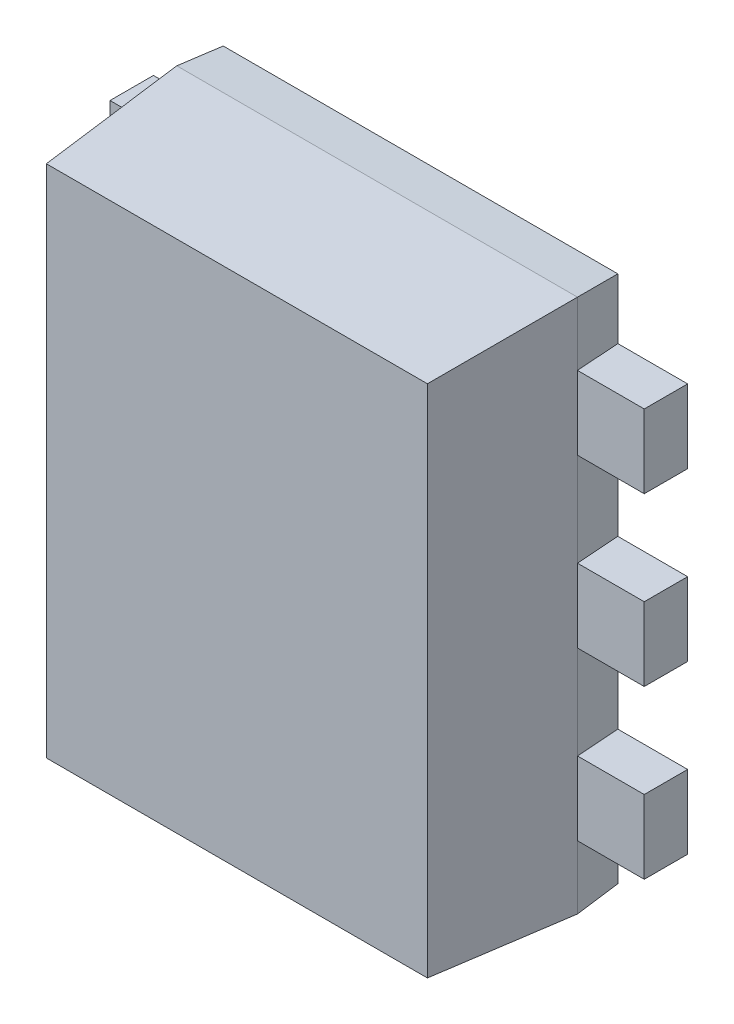
ISO-10303-21;
HEADER;
FILE_DESCRIPTION(('STEP AP214'),'2;1');
FILE_NAME('part.step','',(''),(''),'','','');
FILE_SCHEMA(('AUTOMOTIVE_DESIGN { 1 0 10303 214 1 1 1 1 }'));
ENDSEC;
DATA;
#1=APPLICATION_CONTEXT('core data for automotive mechanical design processes');
#2=APPLICATION_PROTOCOL_DEFINITION('international standard','automotive_design',2000,#1);
#3=PRODUCT_CONTEXT('',#1,'mechanical');
#4=PRODUCT('Part','Part','',(#3));
#5=PRODUCT_RELATED_PRODUCT_CATEGORY('part','',(#4));
#6=PRODUCT_DEFINITION_FORMATION('','',#4);
#7=PRODUCT_DEFINITION_CONTEXT('part definition',#1,'design');
#8=PRODUCT_DEFINITION('design','',#6,#7);
#9=PRODUCT_DEFINITION_SHAPE('','',#8);
#10=(LENGTH_UNIT() NAMED_UNIT(*) SI_UNIT(.MILLI.,.METRE.));
#11=(NAMED_UNIT(*) PLANE_ANGLE_UNIT() SI_UNIT($,.RADIAN.));
#12=(NAMED_UNIT(*) SI_UNIT($,.STERADIAN.) SOLID_ANGLE_UNIT());
#13=UNCERTAINTY_MEASURE_WITH_UNIT(LENGTH_MEASURE(1.E-05),#10,'distance_accuracy_value','');
#14=(GEOMETRIC_REPRESENTATION_CONTEXT(3) GLOBAL_UNCERTAINTY_ASSIGNED_CONTEXT((#13)) GLOBAL_UNIT_ASSIGNED_CONTEXT((#10,
#11,#12)) REPRESENTATION_CONTEXT('',''));
#15=CARTESIAN_POINT('',(0.,0.,0.));
#16=DIRECTION('',(0.,0.,1.));
#17=DIRECTION('',(1.,0.,0.));
#18=AXIS2_PLACEMENT_3D('',#15,#16,#17);
#19=CARTESIAN_POINT('',(0.6,-0.8,0.13));
#20=DIRECTION('',(0.99756405025987,0.,0.0697564737434767));
#21=DIRECTION('',(0.,1.,0.));
#22=AXIS2_PLACEMENT_3D('',#19,#20,#21);
#23=PLANE('',#22);
#24=DIRECTION('',(0.,1.,0.));
#25=VECTOR('',#24,1.);
#26=CARTESIAN_POINT('',(0.570630738984,0.770630738984,0.55));
#27=LINE('',#26,#25);
#28=CARTESIAN_POINT('',(0.570630738984,0.770630738984,0.55));
#29=VERTEX_POINT('',#28);
#30=CARTESIAN_POINT('',(0.570630738984,-0.770630738984,0.55));
#31=VERTEX_POINT('',#30);
#32=EDGE_CURVE('E396',#29,#31,#27,.F.);
#33=ORIENTED_EDGE('',*,*,#32,.T.);
#34=DIRECTION('',(0.0695873743160207,-0.0695873743160207,-0.995145815783599));
#35=VECTOR('',#34,1.);
#36=CARTESIAN_POINT('',(0.585315369492,-0.785315369492,0.34));
#37=LINE('',#36,#35);
#38=CARTESIAN_POINT('',(0.6,-0.8,0.13));
#39=VERTEX_POINT('',#38);
#40=EDGE_CURVE('E450',#31,#39,#37,.T.);
#41=ORIENTED_EDGE('',*,*,#40,.T.);
#42=DIRECTION('',(0.,1.,0.));
#43=VECTOR('',#42,1.);
#44=CARTESIAN_POINT('',(0.6,0.,0.13));
#45=LINE('',#44,#43);
#46=CARTESIAN_POINT('',(0.6,-0.61,0.13));
#47=VERTEX_POINT('',#46);
#48=EDGE_CURVE('E458',#39,#47,#45,.T.);
#49=ORIENTED_EDGE('',*,*,#48,.T.);
#50=DIRECTION('',(0.,1.,0.));
#51=VECTOR('',#50,1.);
#52=CARTESIAN_POINT('',(0.6,-0.61,0.13));
#53=LINE('',#52,#51);
#54=CARTESIAN_POINT('',(0.6,-0.39,0.13));
#55=VERTEX_POINT('',#54);
#56=EDGE_CURVE('E423',#55,#47,#53,.F.);
#57=ORIENTED_EDGE('',*,*,#56,.F.);
#58=DIRECTION('',(0.,1.,0.));
#59=VECTOR('',#58,1.);
#60=CARTESIAN_POINT('',(0.6,0.,0.13));
#61=LINE('',#60,#59);
#62=CARTESIAN_POINT('',(0.6,-0.11,0.13));
#63=VERTEX_POINT('',#62);
#64=EDGE_CURVE('E455',#55,#63,#61,.T.);
#65=ORIENTED_EDGE('',*,*,#64,.T.);
#66=DIRECTION('',(0.,1.,0.));
#67=VECTOR('',#66,1.);
#68=CARTESIAN_POINT('',(0.6,-0.11,0.13));
#69=LINE('',#68,#67);
#70=CARTESIAN_POINT('',(0.6,0.11,0.13));
#71=VERTEX_POINT('',#70);
#72=EDGE_CURVE('E438',#71,#63,#69,.F.);
#73=ORIENTED_EDGE('',*,*,#72,.F.);
#74=DIRECTION('',(0.,1.,0.));
#75=VECTOR('',#74,1.);
#76=CARTESIAN_POINT('',(0.6,0.,0.13));
#77=LINE('',#76,#75);
#78=CARTESIAN_POINT('',(0.6,0.39,0.13));
#79=VERTEX_POINT('',#78);
#80=EDGE_CURVE('E457',#71,#79,#77,.T.);
#81=ORIENTED_EDGE('',*,*,#80,.T.);
#82=DIRECTION('',(0.,1.,0.));
#83=VECTOR('',#82,1.);
#84=CARTESIAN_POINT('',(0.6,0.39,0.13));
#85=LINE('',#84,#83);
#86=CARTESIAN_POINT('',(0.6,0.61,0.13));
#87=VERTEX_POINT('',#86);
#88=EDGE_CURVE('E447',#87,#79,#85,.F.);
#89=ORIENTED_EDGE('',*,*,#88,.F.);
#90=DIRECTION('',(0.,1.,0.));
#91=VECTOR('',#90,1.);
#92=CARTESIAN_POINT('',(0.6,0.,0.13));
#93=LINE('',#92,#91);
#94=CARTESIAN_POINT('',(0.6,0.8,0.13));
#95=VERTEX_POINT('',#94);
#96=EDGE_CURVE('E462',#87,#95,#93,.T.);
#97=ORIENTED_EDGE('',*,*,#96,.T.);
#98=DIRECTION('',(-0.0695873743160207,-0.0695873743160207,0.995145815783599));
#99=VECTOR('',#98,1.);
#100=CARTESIAN_POINT('',(0.585315369492,0.785315369492,0.34));
#101=LINE('',#100,#99);
#102=EDGE_CURVE('E465',#95,#29,#101,.T.);
#103=ORIENTED_EDGE('',*,*,#102,.T.);
#104=EDGE_LOOP('',(#33,#41,#49,#57,#65,#73,#81,#89,#97,#103));
#105=FACE_BOUND('',#104,.T.);
#106=ADVANCED_FACE('F17',(#105),#23,.T.);
#107=CARTESIAN_POINT('',(0.590909514447,0.39,0.13));
#108=DIRECTION('',(0.,0.,1.));
#109=DIRECTION('',(1.,0.,0.));
#110=AXIS2_PLACEMENT_3D('',#107,#108,#109);
#111=PLANE('',#110);
#112=DIRECTION('',(0.,1.,0.));
#113=VECTOR('',#112,1.);
#114=CARTESIAN_POINT('',(0.8,0.39,0.13));
#115=LINE('',#114,#113);
#116=CARTESIAN_POINT('',(0.8,0.61,0.13));
#117=VERTEX_POINT('',#116);
#118=CARTESIAN_POINT('',(0.8,0.39,0.13));
#119=VERTEX_POINT('',#118);
#120=EDGE_CURVE('E390',#117,#119,#115,.F.);
#121=ORIENTED_EDGE('',*,*,#120,.F.);
#122=DIRECTION('',(-1.,0.,0.));
#123=VECTOR('',#122,1.);
#124=CARTESIAN_POINT('',(0.590909514447,0.61,0.13));
#125=LINE('',#124,#123);
#126=EDGE_CURVE('E387',#87,#117,#125,.F.);
#127=ORIENTED_EDGE('',*,*,#126,.F.);
#128=ORIENTED_EDGE('',*,*,#88,.T.);
#129=DIRECTION('',(-1.,0.,0.));
#130=VECTOR('',#129,1.);
#131=CARTESIAN_POINT('',(0.590909514447,0.39,0.13));
#132=LINE('',#131,#130);
#133=EDGE_CURVE('E370',#79,#119,#132,.F.);
#134=ORIENTED_EDGE('',*,*,#133,.T.);
#135=EDGE_LOOP('',(#121,#127,#128,#134));
#136=FACE_BOUND('',#135,.T.);
#137=ADVANCED_FACE('F708',(#136),#111,.T.);
#138=CARTESIAN_POINT('',(0.590909514447,-0.11,0.13));
#139=DIRECTION('',(0.,0.,1.));
#140=DIRECTION('',(1.,0.,0.));
#141=AXIS2_PLACEMENT_3D('',#138,#139,#140);
#142=PLANE('',#141);
#143=DIRECTION('',(0.,1.,0.));
#144=VECTOR('',#143,1.);
#145=CARTESIAN_POINT('',(0.8,-0.11,0.13));
#146=LINE('',#145,#144);
#147=CARTESIAN_POINT('',(0.8,0.11,0.13));
#148=VERTEX_POINT('',#147);
#149=CARTESIAN_POINT('',(0.8,-0.11,0.13));
#150=VERTEX_POINT('',#149);
#151=EDGE_CURVE('E356',#148,#150,#146,.F.);
#152=ORIENTED_EDGE('',*,*,#151,.F.);
#153=DIRECTION('',(-1.,0.,0.));
#154=VECTOR('',#153,1.);
#155=CARTESIAN_POINT('',(0.590909514447,0.11,0.13));
#156=LINE('',#155,#154);
#157=EDGE_CURVE('E355',#71,#148,#156,.F.);
#158=ORIENTED_EDGE('',*,*,#157,.F.);
#159=ORIENTED_EDGE('',*,*,#72,.T.);
#160=DIRECTION('',(-1.,0.,0.));
#161=VECTOR('',#160,1.);
#162=CARTESIAN_POINT('',(0.590909514447,-0.11,0.13));
#163=LINE('',#162,#161);
#164=EDGE_CURVE('E341',#63,#150,#163,.F.);
#165=ORIENTED_EDGE('',*,*,#164,.T.);
#166=EDGE_LOOP('',(#152,#158,#159,#165));
#167=FACE_BOUND('',#166,.T.);
#168=ADVANCED_FACE('F704',(#167),#142,.T.);
#169=CARTESIAN_POINT('',(0.590909514447,-0.61,0.13));
#170=DIRECTION('',(0.,0.,1.));
#171=DIRECTION('',(1.,0.,0.));
#172=AXIS2_PLACEMENT_3D('',#169,#170,#171);
#173=PLANE('',#172);
#174=DIRECTION('',(0.,1.,0.));
#175=VECTOR('',#174,1.);
#176=CARTESIAN_POINT('',(0.8,-0.61,0.13));
#177=LINE('',#176,#175);
#178=CARTESIAN_POINT('',(0.8,-0.39,0.13));
#179=VERTEX_POINT('',#178);
#180=CARTESIAN_POINT('',(0.8,-0.61,0.13));
#181=VERTEX_POINT('',#180);
#182=EDGE_CURVE('E340',#179,#181,#177,.F.);
#183=ORIENTED_EDGE('',*,*,#182,.F.);
#184=DIRECTION('',(-1.,0.,0.));
#185=VECTOR('',#184,1.);
#186=CARTESIAN_POINT('',(0.590909514447,-0.39,0.13));
#187=LINE('',#186,#185);
#188=EDGE_CURVE('E347',#55,#179,#187,.F.);
#189=ORIENTED_EDGE('',*,*,#188,.F.);
#190=ORIENTED_EDGE('',*,*,#56,.T.);
#191=DIRECTION('',(-1.,0.,0.));
#192=VECTOR('',#191,1.);
#193=CARTESIAN_POINT('',(0.590909514447,-0.61,0.13));
#194=LINE('',#193,#192);
#195=EDGE_CURVE('E326',#47,#181,#194,.F.);
#196=ORIENTED_EDGE('',*,*,#195,.T.);
#197=EDGE_LOOP('',(#183,#189,#190,#196));
#198=FACE_BOUND('',#197,.T.);
#199=ADVANCED_FACE('F701',(#198),#173,.T.);
#200=CARTESIAN_POINT('',(-0.590909514447,0.11,0.13));
#201=DIRECTION('',(0.,0.,1.));
#202=DIRECTION('',(1.,0.,0.));
#203=AXIS2_PLACEMENT_3D('',#200,#201,#202);
#204=PLANE('',#203);
#205=DIRECTION('',(0.,-1.,0.));
#206=VECTOR('',#205,1.);
#207=CARTESIAN_POINT('',(-0.8,0.11,0.13));
#208=LINE('',#207,#206);
#209=CARTESIAN_POINT('',(-0.8,-0.11,0.13));
#210=VERTEX_POINT('',#209);
#211=CARTESIAN_POINT('',(-0.8,0.11,0.13));
#212=VERTEX_POINT('',#211);
#213=EDGE_CURVE('E263',#210,#212,#208,.F.);
#214=ORIENTED_EDGE('',*,*,#213,.F.);
#215=DIRECTION('',(1.,0.,0.));
#216=VECTOR('',#215,1.);
#217=CARTESIAN_POINT('',(-0.590909514447,-0.11,0.13));
#218=LINE('',#217,#216);
#219=CARTESIAN_POINT('',(-0.6,-0.11,0.13));
#220=VERTEX_POINT('',#219);
#221=EDGE_CURVE('E262',#220,#210,#218,.F.);
#222=ORIENTED_EDGE('',*,*,#221,.F.);
#223=DIRECTION('',(0.,-1.,0.));
#224=VECTOR('',#223,1.);
#225=CARTESIAN_POINT('',(-0.6,0.,0.13));
#226=LINE('',#225,#224);
#227=CARTESIAN_POINT('',(-0.6,0.11,0.13));
#228=VERTEX_POINT('',#227);
#229=EDGE_CURVE('E215',#228,#220,#226,.T.);
#230=ORIENTED_EDGE('',*,*,#229,.F.);
#231=DIRECTION('',(1.,0.,0.));
#232=VECTOR('',#231,1.);
#233=CARTESIAN_POINT('',(-0.590909514447,0.11,0.13));
#234=LINE('',#233,#232);
#235=EDGE_CURVE('E261',#228,#212,#234,.F.);
#236=ORIENTED_EDGE('',*,*,#235,.T.);
#237=EDGE_LOOP('',(#214,#222,#230,#236));
#238=FACE_BOUND('',#237,.T.);
#239=ADVANCED_FACE('F698',(#238),#204,.T.);
#240=CARTESIAN_POINT('',(-0.590909514447,-0.39,0.13));
#241=DIRECTION('',(0.,0.,1.));
#242=DIRECTION('',(1.,0.,0.));
#243=AXIS2_PLACEMENT_3D('',#240,#241,#242);
#244=PLANE('',#243);
#245=DIRECTION('',(0.,-1.,0.));
#246=VECTOR('',#245,1.);
#247=CARTESIAN_POINT('',(-0.8,-0.39,0.13));
#248=LINE('',#247,#246);
#249=CARTESIAN_POINT('',(-0.8,-0.61,0.13));
#250=VERTEX_POINT('',#249);
#251=CARTESIAN_POINT('',(-0.8,-0.39,0.13));
#252=VERTEX_POINT('',#251);
#253=EDGE_CURVE('E309',#250,#252,#248,.F.);
#254=ORIENTED_EDGE('',*,*,#253,.F.);
#255=DIRECTION('',(1.,0.,0.));
#256=VECTOR('',#255,1.);
#257=CARTESIAN_POINT('',(-0.590909514447,-0.61,0.13));
#258=LINE('',#257,#256);
#259=CARTESIAN_POINT('',(-0.6,-0.61,0.13));
#260=VERTEX_POINT('',#259);
#261=EDGE_CURVE('E306',#260,#250,#258,.F.);
#262=ORIENTED_EDGE('',*,*,#261,.F.);
#263=DIRECTION('',(0.,-1.,0.));
#264=VECTOR('',#263,1.);
#265=CARTESIAN_POINT('',(-0.6,0.,0.13));
#266=LINE('',#265,#264);
#267=CARTESIAN_POINT('',(-0.6,-0.39,0.13));
#268=VERTEX_POINT('',#267);
#269=EDGE_CURVE('E282',#268,#260,#266,.T.);
#270=ORIENTED_EDGE('',*,*,#269,.F.);
#271=DIRECTION('',(1.,0.,0.));
#272=VECTOR('',#271,1.);
#273=CARTESIAN_POINT('',(-0.590909514447,-0.39,0.13));
#274=LINE('',#273,#272);
#275=EDGE_CURVE('E286',#268,#252,#274,.F.);
#276=ORIENTED_EDGE('',*,*,#275,.T.);
#277=EDGE_LOOP('',(#254,#262,#270,#276));
#278=FACE_BOUND('',#277,.T.);
#279=ADVANCED_FACE('F695',(#278),#244,.T.);
#280=CARTESIAN_POINT('',(-0.570630738984,0.770630738984,0.55));
#281=DIRECTION('',(0.,0.,-1.));
#282=DIRECTION('',(-1.,0.,0.));
#283=AXIS2_PLACEMENT_3D('',#280,#281,#282);
#284=PLANE('',#283);
#285=DIRECTION('',(-1.,0.,0.));
#286=VECTOR('',#285,1.);
#287=CARTESIAN_POINT('',(0.,-0.770630738984,0.55));
#288=LINE('',#287,#286);
#289=CARTESIAN_POINT('',(-0.570630738984,-0.770630738984,0.55));
#290=VERTEX_POINT('',#289);
#291=EDGE_CURVE('E312',#31,#290,#288,.T.);
#292=ORIENTED_EDGE('',*,*,#291,.F.);
#293=ORIENTED_EDGE('',*,*,#32,.F.);
#294=DIRECTION('',(1.,0.,0.));
#295=VECTOR('',#294,1.);
#296=CARTESIAN_POINT('',(0.,0.770630738984,0.55));
#297=LINE('',#296,#295);
#298=CARTESIAN_POINT('',(-0.570630738984,0.770630738984,0.55));
#299=VERTEX_POINT('',#298);
#300=EDGE_CURVE('E393',#299,#29,#297,.T.);
#301=ORIENTED_EDGE('',*,*,#300,.F.);
#302=DIRECTION('',(0.,1.,0.));
#303=VECTOR('',#302,1.);
#304=CARTESIAN_POINT('',(-0.570630738984,0.,0.55));
#305=LINE('',#304,#303);
#306=EDGE_CURVE('E559',#290,#299,#305,.T.);
#307=ORIENTED_EDGE('',*,*,#306,.F.);
#308=EDGE_LOOP('',(#292,#293,#301,#307));
#309=FACE_BOUND('',#308,.T.);
#310=ADVANCED_FACE('F606',(#309),#284,.F.);
#311=CARTESIAN_POINT('',(-0.590909514447,0.61,0.13));
#312=DIRECTION('',(0.,0.,1.));
#313=DIRECTION('',(1.,0.,0.));
#314=AXIS2_PLACEMENT_3D('',#311,#312,#313);
#315=PLANE('',#314);
#316=DIRECTION('',(0.,-1.,0.));
#317=VECTOR('',#316,1.);
#318=CARTESIAN_POINT('',(-0.8,0.61,0.13));
#319=LINE('',#318,#317);
#320=CARTESIAN_POINT('',(-0.8,0.39,0.13));
#321=VERTEX_POINT('',#320);
#322=CARTESIAN_POINT('',(-0.8,0.61,0.13));
#323=VERTEX_POINT('',#322);
#324=EDGE_CURVE('E226',#321,#323,#319,.F.);
#325=ORIENTED_EDGE('',*,*,#324,.F.);
#326=DIRECTION('',(1.,0.,0.));
#327=VECTOR('',#326,1.);
#328=CARTESIAN_POINT('',(-0.590909514447,0.39,0.13));
#329=LINE('',#328,#327);
#330=CARTESIAN_POINT('',(-0.6,0.39,0.13));
#331=VERTEX_POINT('',#330);
#332=EDGE_CURVE('E221',#331,#321,#329,.F.);
#333=ORIENTED_EDGE('',*,*,#332,.F.);
#334=DIRECTION('',(0.,-1.,0.));
#335=VECTOR('',#334,1.);
#336=CARTESIAN_POINT('',(-0.6,0.,0.13));
#337=LINE('',#336,#335);
#338=CARTESIAN_POINT('',(-0.6,0.61,0.13));
#339=VERTEX_POINT('',#338);
#340=EDGE_CURVE('E224',#339,#331,#337,.T.);
#341=ORIENTED_EDGE('',*,*,#340,.F.);
#342=DIRECTION('',(1.,0.,0.));
#343=VECTOR('',#342,1.);
#344=CARTESIAN_POINT('',(-0.590909514447,0.61,0.13));
#345=LINE('',#344,#343);
#346=EDGE_CURVE('E403',#339,#323,#345,.F.);
#347=ORIENTED_EDGE('',*,*,#346,.T.);
#348=EDGE_LOOP('',(#325,#333,#341,#347));
#349=FACE_BOUND('',#348,.T.);
#350=ADVANCED_FACE('F222',(#349),#315,.T.);
#351=CARTESIAN_POINT('',(0.6,0.8,0.13));
#352=DIRECTION('',(0.,0.99756405025987,0.0697564737434767));
#353=DIRECTION('',(-1.,0.,0.));
#354=AXIS2_PLACEMENT_3D('',#351,#352,#353);
#355=PLANE('',#354);
#356=ORIENTED_EDGE('',*,*,#300,.T.);
#357=ORIENTED_EDGE('',*,*,#102,.F.);
#358=DIRECTION('',(1.,0.,0.));
#359=VECTOR('',#358,1.);
#360=CARTESIAN_POINT('',(0.,0.8,0.13));
#361=LINE('',#360,#359);
#362=CARTESIAN_POINT('',(-0.6,0.8,0.13));
#363=VERTEX_POINT('',#362);
#364=EDGE_CURVE('E477',#363,#95,#361,.T.);
#365=ORIENTED_EDGE('',*,*,#364,.F.);
#366=DIRECTION('',(-0.0695873743160207,0.0695873743160207,-0.995145815783599));
#367=VECTOR('',#366,1.);
#368=CARTESIAN_POINT('',(-0.585315369492,0.785315369492,0.34));
#369=LINE('',#368,#367);
#370=EDGE_CURVE('E406',#299,#363,#369,.T.);
#371=ORIENTED_EDGE('',*,*,#370,.F.);
#372=EDGE_LOOP('',(#356,#357,#365,#371));
#373=FACE_BOUND('',#372,.T.);
#374=ADVANCED_FACE('F612',(#373),#355,.T.);
#375=CARTESIAN_POINT('',(0.8,0.39,0.));
#376=DIRECTION('',(1.,0.,0.));
#377=DIRECTION('',(0.,1.,0.));
#378=AXIS2_PLACEMENT_3D('',#375,#376,#377);
#379=PLANE('',#378);
#380=DIRECTION('',(0.,0.,1.));
#381=VECTOR('',#380,1.);
#382=CARTESIAN_POINT('',(0.8,0.61,0.));
#383=LINE('',#382,#381);
#384=CARTESIAN_POINT('',(0.8,0.61,0.));
#385=VERTEX_POINT('',#384);
#386=EDGE_CURVE('E372',#117,#385,#383,.F.);
#387=ORIENTED_EDGE('',*,*,#386,.F.);
#388=ORIENTED_EDGE('',*,*,#120,.T.);
#389=DIRECTION('',(0.,0.,1.));
#390=VECTOR('',#389,1.);
#391=CARTESIAN_POINT('',(0.8,0.39,0.));
#392=LINE('',#391,#390);
#393=CARTESIAN_POINT('',(0.8,0.39,0.));
#394=VERTEX_POINT('',#393);
#395=EDGE_CURVE('E359',#119,#394,#392,.F.);
#396=ORIENTED_EDGE('',*,*,#395,.T.);
#397=DIRECTION('',(0.,1.,0.));
#398=VECTOR('',#397,1.);
#399=CARTESIAN_POINT('',(0.8,0.39,0.));
#400=LINE('',#399,#398);
#401=EDGE_CURVE('E363',#394,#385,#400,.T.);
#402=ORIENTED_EDGE('',*,*,#401,.T.);
#403=EDGE_LOOP('',(#387,#388,#396,#402));
#404=FACE_BOUND('',#403,.T.);
#405=ADVANCED_FACE('F687',(#404),#379,.T.);
#406=CARTESIAN_POINT('',(0.590909514447,0.61,0.));
#407=DIRECTION('',(0.,1.,0.));
#408=DIRECTION('',(-1.,0.,0.));
#409=AXIS2_PLACEMENT_3D('',#406,#407,#408);
#410=PLANE('',#409);
#411=ORIENTED_EDGE('',*,*,#126,.T.);
#412=ORIENTED_EDGE('',*,*,#386,.T.);
#413=DIRECTION('',(1.,0.,0.));
#414=VECTOR('',#413,1.);
#415=CARTESIAN_POINT('',(0.590909514447,0.61,0.));
#416=LINE('',#415,#414);
#417=CARTESIAN_POINT('',(0.590909514447,0.61,0.));
#418=VERTEX_POINT('',#417);
#419=EDGE_CURVE('E379',#385,#418,#416,.F.);
#420=ORIENTED_EDGE('',*,*,#419,.T.);
#421=DIRECTION('',(0.069756473746749,0.,0.997564050259641));
#422=VECTOR('',#421,1.);
#423=CARTESIAN_POINT('',(0.590909514447,0.61,0.));
#424=LINE('',#423,#422);
#425=EDGE_CURVE('E474',#87,#418,#424,.F.);
#426=ORIENTED_EDGE('',*,*,#425,.F.);
#427=EDGE_LOOP('',(#411,#412,#420,#426));
#428=FACE_BOUND('',#427,.T.);
#429=ADVANCED_FACE('F683',(#428),#410,.T.);
#430=CARTESIAN_POINT('',(0.590909514447,0.39,0.));
#431=DIRECTION('',(0.,1.,0.));
#432=DIRECTION('',(-1.,0.,0.));
#433=AXIS2_PLACEMENT_3D('',#430,#431,#432);
#434=PLANE('',#433);
#435=ORIENTED_EDGE('',*,*,#133,.F.);
#436=DIRECTION('',(0.069756473746749,0.,0.997564050259641));
#437=VECTOR('',#436,1.);
#438=CARTESIAN_POINT('',(0.590909514447,0.39,0.));
#439=LINE('',#438,#437);
#440=CARTESIAN_POINT('',(0.590909514447,0.39,0.));
#441=VERTEX_POINT('',#440);
#442=EDGE_CURVE('E509',#441,#79,#439,.T.);
#443=ORIENTED_EDGE('',*,*,#442,.F.);
#444=DIRECTION('',(1.,0.,0.));
#445=VECTOR('',#444,1.);
#446=CARTESIAN_POINT('',(0.590909514447,0.39,0.));
#447=LINE('',#446,#445);
#448=EDGE_CURVE('E360',#441,#394,#447,.T.);
#449=ORIENTED_EDGE('',*,*,#448,.T.);
#450=ORIENTED_EDGE('',*,*,#395,.F.);
#451=EDGE_LOOP('',(#435,#443,#449,#450));
#452=FACE_BOUND('',#451,.T.);
#453=ADVANCED_FACE('F679',(#452),#434,.F.);
#454=CARTESIAN_POINT('',(0.8,-0.11,0.));
#455=DIRECTION('',(1.,0.,0.));
#456=DIRECTION('',(0.,1.,0.));
#457=AXIS2_PLACEMENT_3D('',#454,#455,#456);
#458=PLANE('',#457);
#459=DIRECTION('',(0.,0.,1.));
#460=VECTOR('',#459,1.);
#461=CARTESIAN_POINT('',(0.8,0.11,0.));
#462=LINE('',#461,#460);
#463=CARTESIAN_POINT('',(0.8,0.11,0.));
#464=VERTEX_POINT('',#463);
#465=EDGE_CURVE('E352',#148,#464,#462,.F.);
#466=ORIENTED_EDGE('',*,*,#465,.F.);
#467=ORIENTED_EDGE('',*,*,#151,.T.);
#468=DIRECTION('',(0.,0.,1.));
#469=VECTOR('',#468,1.);
#470=CARTESIAN_POINT('',(0.8,-0.11,0.));
#471=LINE('',#470,#469);
#472=CARTESIAN_POINT('',(0.8,-0.11,0.));
#473=VERTEX_POINT('',#472);
#474=EDGE_CURVE('E338',#150,#473,#471,.F.);
#475=ORIENTED_EDGE('',*,*,#474,.T.);
#476=DIRECTION('',(0.,1.,0.));
#477=VECTOR('',#476,1.);
#478=CARTESIAN_POINT('',(0.8,-0.11,0.));
#479=LINE('',#478,#477);
#480=EDGE_CURVE('E505',#473,#464,#479,.T.);
#481=ORIENTED_EDGE('',*,*,#480,.T.);
#482=EDGE_LOOP('',(#466,#467,#475,#481));
#483=FACE_BOUND('',#482,.T.);
#484=ADVANCED_FACE('F675',(#483),#458,.T.);
#485=CARTESIAN_POINT('',(0.590909514447,0.11,0.));
#486=DIRECTION('',(0.,1.,0.));
#487=DIRECTION('',(-1.,0.,0.));
#488=AXIS2_PLACEMENT_3D('',#485,#486,#487);
#489=PLANE('',#488);
#490=ORIENTED_EDGE('',*,*,#157,.T.);
#491=ORIENTED_EDGE('',*,*,#465,.T.);
#492=DIRECTION('',(1.,0.,0.));
#493=VECTOR('',#492,1.);
#494=CARTESIAN_POINT('',(0.590909514447,0.11,0.));
#495=LINE('',#494,#493);
#496=CARTESIAN_POINT('',(0.590909514447,0.11,0.));
#497=VERTEX_POINT('',#496);
#498=EDGE_CURVE('E502',#464,#497,#495,.F.);
#499=ORIENTED_EDGE('',*,*,#498,.T.);
#500=DIRECTION('',(-0.069756473746749,0.,-0.997564050259641));
#501=VECTOR('',#500,1.);
#502=CARTESIAN_POINT('',(0.590909514447,0.11,0.));
#503=LINE('',#502,#501);
#504=EDGE_CURVE('E383',#71,#497,#503,.T.);
#505=ORIENTED_EDGE('',*,*,#504,.F.);
#506=EDGE_LOOP('',(#490,#491,#499,#505));
#507=FACE_BOUND('',#506,.T.);
#508=ADVANCED_FACE('F671',(#507),#489,.T.);
#509=CARTESIAN_POINT('',(0.590909514447,-0.11,0.));
#510=DIRECTION('',(0.,1.,0.));
#511=DIRECTION('',(-1.,0.,0.));
#512=AXIS2_PLACEMENT_3D('',#509,#510,#511);
#513=PLANE('',#512);
#514=ORIENTED_EDGE('',*,*,#164,.F.);
#515=DIRECTION('',(0.069756473746749,0.,0.997564050259641));
#516=VECTOR('',#515,1.);
#517=CARTESIAN_POINT('',(0.590909514447,-0.11,0.));
#518=LINE('',#517,#516);
#519=CARTESIAN_POINT('',(0.590909514447,-0.11,0.));
#520=VERTEX_POINT('',#519);
#521=EDGE_CURVE('E319',#520,#63,#518,.T.);
#522=ORIENTED_EDGE('',*,*,#521,.F.);
#523=DIRECTION('',(1.,0.,0.));
#524=VECTOR('',#523,1.);
#525=CARTESIAN_POINT('',(0.590909514447,-0.11,0.));
#526=LINE('',#525,#524);
#527=EDGE_CURVE('E506',#520,#473,#526,.T.);
#528=ORIENTED_EDGE('',*,*,#527,.T.);
#529=ORIENTED_EDGE('',*,*,#474,.F.);
#530=EDGE_LOOP('',(#514,#522,#528,#529));
#531=FACE_BOUND('',#530,.T.);
#532=ADVANCED_FACE('F667',(#531),#513,.F.);
#533=CARTESIAN_POINT('',(0.8,-0.61,0.));
#534=DIRECTION('',(1.,0.,0.));
#535=DIRECTION('',(0.,1.,0.));
#536=AXIS2_PLACEMENT_3D('',#533,#534,#535);
#537=PLANE('',#536);
#538=DIRECTION('',(0.,0.,1.));
#539=VECTOR('',#538,1.);
#540=CARTESIAN_POINT('',(0.8,-0.39,0.));
#541=LINE('',#540,#539);
#542=CARTESIAN_POINT('',(0.8,-0.39,0.));
#543=VERTEX_POINT('',#542);
#544=EDGE_CURVE('E328',#179,#543,#541,.F.);
#545=ORIENTED_EDGE('',*,*,#544,.F.);
#546=ORIENTED_EDGE('',*,*,#182,.T.);
#547=DIRECTION('',(0.,0.,1.));
#548=VECTOR('',#547,1.);
#549=CARTESIAN_POINT('',(0.8,-0.61,0.));
#550=LINE('',#549,#548);
#551=CARTESIAN_POINT('',(0.8,-0.61,0.));
#552=VERTEX_POINT('',#551);
#553=EDGE_CURVE('E314',#181,#552,#550,.F.);
#554=ORIENTED_EDGE('',*,*,#553,.T.);
#555=DIRECTION('',(0.,1.,0.));
#556=VECTOR('',#555,1.);
#557=CARTESIAN_POINT('',(0.8,-0.61,0.));
#558=LINE('',#557,#556);
#559=EDGE_CURVE('E318',#552,#543,#558,.T.);
#560=ORIENTED_EDGE('',*,*,#559,.T.);
#561=EDGE_LOOP('',(#545,#546,#554,#560));
#562=FACE_BOUND('',#561,.T.);
#563=ADVANCED_FACE('F663',(#562),#537,.T.);
#564=CARTESIAN_POINT('',(0.590909514447,-0.39,0.));
#565=DIRECTION('',(0.,1.,0.));
#566=DIRECTION('',(-1.,0.,0.));
#567=AXIS2_PLACEMENT_3D('',#564,#565,#566);
#568=PLANE('',#567);
#569=ORIENTED_EDGE('',*,*,#188,.T.);
#570=ORIENTED_EDGE('',*,*,#544,.T.);
#571=DIRECTION('',(1.,0.,0.));
#572=VECTOR('',#571,1.);
#573=CARTESIAN_POINT('',(0.590909514447,-0.39,0.));
#574=LINE('',#573,#572);
#575=CARTESIAN_POINT('',(0.590909514447,-0.39,0.));
#576=VERTEX_POINT('',#575);
#577=EDGE_CURVE('E335',#543,#576,#574,.F.);
#578=ORIENTED_EDGE('',*,*,#577,.T.);
#579=DIRECTION('',(0.069756473746749,0.,0.997564050259641));
#580=VECTOR('',#579,1.);
#581=CARTESIAN_POINT('',(0.590909514447,-0.39,0.));
#582=LINE('',#581,#580);
#583=EDGE_CURVE('E504',#55,#576,#582,.F.);
#584=ORIENTED_EDGE('',*,*,#583,.F.);
#585=EDGE_LOOP('',(#569,#570,#578,#584));
#586=FACE_BOUND('',#585,.T.);
#587=ADVANCED_FACE('F659',(#586),#568,.T.);
#588=CARTESIAN_POINT('',(0.590909514447,-0.61,0.));
#589=DIRECTION('',(0.,1.,0.));
#590=DIRECTION('',(-1.,0.,0.));
#591=AXIS2_PLACEMENT_3D('',#588,#589,#590);
#592=PLANE('',#591);
#593=ORIENTED_EDGE('',*,*,#195,.F.);
#594=DIRECTION('',(0.069756473746749,0.,0.997564050259641));
#595=VECTOR('',#594,1.);
#596=CARTESIAN_POINT('',(0.590909514447,-0.61,0.));
#597=LINE('',#596,#595);
#598=CARTESIAN_POINT('',(0.590909514447,-0.61,0.));
#599=VERTEX_POINT('',#598);
#600=EDGE_CURVE('E343',#599,#47,#597,.T.);
#601=ORIENTED_EDGE('',*,*,#600,.F.);
#602=DIRECTION('',(1.,0.,0.));
#603=VECTOR('',#602,1.);
#604=CARTESIAN_POINT('',(0.590909514447,-0.61,0.));
#605=LINE('',#604,#603);
#606=EDGE_CURVE('E315',#599,#552,#605,.T.);
#607=ORIENTED_EDGE('',*,*,#606,.T.);
#608=ORIENTED_EDGE('',*,*,#553,.F.);
#609=EDGE_LOOP('',(#593,#601,#607,#608));
#610=FACE_BOUND('',#609,.T.);
#611=ADVANCED_FACE('F656',(#610),#592,.F.);
#612=CARTESIAN_POINT('',(-0.6,-0.8,0.13));
#613=DIRECTION('',(0.,-0.99756405025987,0.0697564737434767));
#614=DIRECTION('',(1.,0.,0.));
#615=AXIS2_PLACEMENT_3D('',#612,#613,#614);
#616=PLANE('',#615);
#617=ORIENTED_EDGE('',*,*,#291,.T.);
#618=DIRECTION('',(0.0695873743160207,0.0695873743160207,0.995145815783599));
#619=VECTOR('',#618,1.);
#620=CARTESIAN_POINT('',(-0.585315369492,-0.785315369492,0.34));
#621=LINE('',#620,#619);
#622=CARTESIAN_POINT('',(-0.6,-0.8,0.13));
#623=VERTEX_POINT('',#622);
#624=EDGE_CURVE('E285',#623,#290,#621,.T.);
#625=ORIENTED_EDGE('',*,*,#624,.F.);
#626=DIRECTION('',(-1.,0.,0.));
#627=VECTOR('',#626,1.);
#628=CARTESIAN_POINT('',(0.,-0.8,0.13));
#629=LINE('',#628,#627);
#630=EDGE_CURVE('E490',#39,#623,#629,.T.);
#631=ORIENTED_EDGE('',*,*,#630,.F.);
#632=ORIENTED_EDGE('',*,*,#40,.F.);
#633=EDGE_LOOP('',(#617,#625,#631,#632));
#634=FACE_BOUND('',#633,.T.);
#635=ADVANCED_FACE('F599',(#634),#616,.T.);
#636=CARTESIAN_POINT('',(-0.8,-0.39,0.));
#637=DIRECTION('',(-1.,0.,0.));
#638=DIRECTION('',(0.,-1.,0.));
#639=AXIS2_PLACEMENT_3D('',#636,#637,#638);
#640=PLANE('',#639);
#641=DIRECTION('',(0.,0.,1.));
#642=VECTOR('',#641,1.);
#643=CARTESIAN_POINT('',(-0.8,-0.61,0.));
#644=LINE('',#643,#642);
#645=CARTESIAN_POINT('',(-0.8,-0.61,0.));
#646=VERTEX_POINT('',#645);
#647=EDGE_CURVE('E288',#250,#646,#644,.F.);
#648=ORIENTED_EDGE('',*,*,#647,.F.);
#649=ORIENTED_EDGE('',*,*,#253,.T.);
#650=DIRECTION('',(0.,0.,1.));
#651=VECTOR('',#650,1.);
#652=CARTESIAN_POINT('',(-0.8,-0.39,0.));
#653=LINE('',#652,#651);
#654=CARTESIAN_POINT('',(-0.8,-0.39,0.));
#655=VERTEX_POINT('',#654);
#656=EDGE_CURVE('E266',#252,#655,#653,.F.);
#657=ORIENTED_EDGE('',*,*,#656,.T.);
#658=DIRECTION('',(0.,1.,0.));
#659=VECTOR('',#658,1.);
#660=CARTESIAN_POINT('',(-0.8,-0.39,0.));
#661=LINE('',#660,#659);
#662=EDGE_CURVE('E270',#655,#646,#661,.F.);
#663=ORIENTED_EDGE('',*,*,#662,.T.);
#664=EDGE_LOOP('',(#648,#649,#657,#663));
#665=FACE_BOUND('',#664,.T.);
#666=ADVANCED_FACE('F651',(#665),#640,.T.);
#667=CARTESIAN_POINT('',(-0.590909514447,-0.61,0.));
#668=DIRECTION('',(0.,-1.,0.));
#669=DIRECTION('',(1.,0.,0.));
#670=AXIS2_PLACEMENT_3D('',#667,#668,#669);
#671=PLANE('',#670);
#672=ORIENTED_EDGE('',*,*,#261,.T.);
#673=ORIENTED_EDGE('',*,*,#647,.T.);
#674=DIRECTION('',(1.,0.,0.));
#675=VECTOR('',#674,1.);
#676=CARTESIAN_POINT('',(-0.590909514447,-0.61,0.));
#677=LINE('',#676,#675);
#678=CARTESIAN_POINT('',(-0.590909514447,-0.61,0.));
#679=VERTEX_POINT('',#678);
#680=EDGE_CURVE('E295',#646,#679,#677,.T.);
#681=ORIENTED_EDGE('',*,*,#680,.T.);
#682=DIRECTION('',(-0.069756473746749,0.,0.997564050259641));
#683=VECTOR('',#682,1.);
#684=CARTESIAN_POINT('',(-0.590909514447,-0.61,0.));
#685=LINE('',#684,#683);
#686=EDGE_CURVE('E495',#260,#679,#685,.F.);
#687=ORIENTED_EDGE('',*,*,#686,.F.);
#688=EDGE_LOOP('',(#672,#673,#681,#687));
#689=FACE_BOUND('',#688,.T.);
#690=ADVANCED_FACE('F647',(#689),#671,.T.);
#691=CARTESIAN_POINT('',(-0.590909514447,-0.39,0.));
#692=DIRECTION('',(0.,-1.,0.));
#693=DIRECTION('',(1.,0.,0.));
#694=AXIS2_PLACEMENT_3D('',#691,#692,#693);
#695=PLANE('',#694);
#696=ORIENTED_EDGE('',*,*,#275,.F.);
#697=DIRECTION('',(-0.069756473746749,0.,0.997564050259641));
#698=VECTOR('',#697,1.);
#699=CARTESIAN_POINT('',(-0.590909514447,-0.39,0.));
#700=LINE('',#699,#698);
#701=CARTESIAN_POINT('',(-0.590909514447,-0.39,0.));
#702=VERTEX_POINT('',#701);
#703=EDGE_CURVE('E281',#702,#268,#700,.T.);
#704=ORIENTED_EDGE('',*,*,#703,.F.);
#705=DIRECTION('',(1.,0.,0.));
#706=VECTOR('',#705,1.);
#707=CARTESIAN_POINT('',(-0.590909514447,-0.39,0.));
#708=LINE('',#707,#706);
#709=EDGE_CURVE('E267',#702,#655,#708,.F.);
#710=ORIENTED_EDGE('',*,*,#709,.T.);
#711=ORIENTED_EDGE('',*,*,#656,.F.);
#712=EDGE_LOOP('',(#696,#704,#710,#711));
#713=FACE_BOUND('',#712,.T.);
#714=ADVANCED_FACE('F644',(#713),#695,.F.);
#715=CARTESIAN_POINT('',(-0.8,0.11,0.));
#716=DIRECTION('',(-1.,0.,0.));
#717=DIRECTION('',(0.,-1.,0.));
#718=AXIS2_PLACEMENT_3D('',#715,#716,#717);
#719=PLANE('',#718);
#720=DIRECTION('',(0.,0.,1.));
#721=VECTOR('',#720,1.);
#722=CARTESIAN_POINT('',(-0.8,-0.11,0.));
#723=LINE('',#722,#721);
#724=CARTESIAN_POINT('',(-0.8,-0.11,0.));
#725=VERTEX_POINT('',#724);
#726=EDGE_CURVE('E258',#210,#725,#723,.F.);
#727=ORIENTED_EDGE('',*,*,#726,.F.);
#728=ORIENTED_EDGE('',*,*,#213,.T.);
#729=DIRECTION('',(0.,0.,1.));
#730=VECTOR('',#729,1.);
#731=CARTESIAN_POINT('',(-0.8,0.11,0.));
#732=LINE('',#731,#730);
#733=CARTESIAN_POINT('',(-0.8,0.11,0.));
#734=VERTEX_POINT('',#733);
#735=EDGE_CURVE('E246',#212,#734,#732,.F.);
#736=ORIENTED_EDGE('',*,*,#735,.T.);
#737=DIRECTION('',(0.,1.,0.));
#738=VECTOR('',#737,1.);
#739=CARTESIAN_POINT('',(-0.8,0.11,0.));
#740=LINE('',#739,#738);
#741=EDGE_CURVE('E514',#734,#725,#740,.F.);
#742=ORIENTED_EDGE('',*,*,#741,.T.);
#743=EDGE_LOOP('',(#727,#728,#736,#742));
#744=FACE_BOUND('',#743,.T.);
#745=ADVANCED_FACE('F565',(#744),#719,.T.);
#746=CARTESIAN_POINT('',(-0.590909514447,-0.11,0.));
#747=DIRECTION('',(0.,-1.,0.));
#748=DIRECTION('',(1.,0.,0.));
#749=AXIS2_PLACEMENT_3D('',#746,#747,#748);
#750=PLANE('',#749);
#751=ORIENTED_EDGE('',*,*,#221,.T.);
#752=ORIENTED_EDGE('',*,*,#726,.T.);
#753=DIRECTION('',(1.,0.,0.));
#754=VECTOR('',#753,1.);
#755=CARTESIAN_POINT('',(-0.590909514447,-0.11,0.));
#756=LINE('',#755,#754);
#757=CARTESIAN_POINT('',(-0.590909514447,-0.11,0.));
#758=VERTEX_POINT('',#757);
#759=EDGE_CURVE('E235',#725,#758,#756,.T.);
#760=ORIENTED_EDGE('',*,*,#759,.T.);
#761=DIRECTION('',(0.069756473746749,0.,-0.997564050259641));
#762=VECTOR('',#761,1.);
#763=CARTESIAN_POINT('',(-0.590909514447,-0.11,0.));
#764=LINE('',#763,#762);
#765=EDGE_CURVE('E302',#220,#758,#764,.T.);
#766=ORIENTED_EDGE('',*,*,#765,.F.);
#767=EDGE_LOOP('',(#751,#752,#760,#766));
#768=FACE_BOUND('',#767,.T.);
#769=ADVANCED_FACE('F575',(#768),#750,.T.);
#770=CARTESIAN_POINT('',(-0.590909514447,0.11,0.));
#771=DIRECTION('',(0.,-1.,0.));
#772=DIRECTION('',(1.,0.,0.));
#773=AXIS2_PLACEMENT_3D('',#770,#771,#772);
#774=PLANE('',#773);
#775=ORIENTED_EDGE('',*,*,#235,.F.);
#776=DIRECTION('',(-0.069756473746749,0.,0.997564050259641));
#777=VECTOR('',#776,1.);
#778=CARTESIAN_POINT('',(-0.590909514447,0.11,0.));
#779=LINE('',#778,#777);
#780=CARTESIAN_POINT('',(-0.590909514447,0.11,0.));
#781=VERTEX_POINT('',#780);
#782=EDGE_CURVE('E234',#781,#228,#779,.T.);
#783=ORIENTED_EDGE('',*,*,#782,.F.);
#784=DIRECTION('',(1.,0.,0.));
#785=VECTOR('',#784,1.);
#786=CARTESIAN_POINT('',(-0.590909514447,0.11,0.));
#787=LINE('',#786,#785);
#788=EDGE_CURVE('E280',#781,#734,#787,.F.);
#789=ORIENTED_EDGE('',*,*,#788,.T.);
#790=ORIENTED_EDGE('',*,*,#735,.F.);
#791=EDGE_LOOP('',(#775,#783,#789,#790));
#792=FACE_BOUND('',#791,.T.);
#793=ADVANCED_FACE('F569',(#792),#774,.F.);
#794=CARTESIAN_POINT('',(-0.6,0.8,0.13));
#795=DIRECTION('',(-0.99756405025987,0.,0.0697564737434767));
#796=DIRECTION('',(0.,-1.,0.));
#797=AXIS2_PLACEMENT_3D('',#794,#795,#796);
#798=PLANE('',#797);
#799=ORIENTED_EDGE('',*,*,#306,.T.);
#800=ORIENTED_EDGE('',*,*,#370,.T.);
#801=DIRECTION('',(0.,1.,0.));
#802=VECTOR('',#801,1.);
#803=CARTESIAN_POINT('',(-0.6,0.,0.13));
#804=LINE('',#803,#802);
#805=EDGE_CURVE('E245',#339,#363,#804,.T.);
#806=ORIENTED_EDGE('',*,*,#805,.F.);
#807=ORIENTED_EDGE('',*,*,#340,.T.);
#808=DIRECTION('',(0.,1.,0.));
#809=VECTOR('',#808,1.);
#810=CARTESIAN_POINT('',(-0.6,0.,0.13));
#811=LINE('',#810,#809);
#812=EDGE_CURVE('E242',#228,#331,#811,.T.);
#813=ORIENTED_EDGE('',*,*,#812,.F.);
#814=ORIENTED_EDGE('',*,*,#229,.T.);
#815=DIRECTION('',(0.,1.,0.));
#816=VECTOR('',#815,1.);
#817=CARTESIAN_POINT('',(-0.6,0.,0.13));
#818=LINE('',#817,#816);
#819=EDGE_CURVE('E277',#268,#220,#818,.T.);
#820=ORIENTED_EDGE('',*,*,#819,.F.);
#821=ORIENTED_EDGE('',*,*,#269,.T.);
#822=DIRECTION('',(0.,1.,0.));
#823=VECTOR('',#822,1.);
#824=CARTESIAN_POINT('',(-0.6,0.,0.13));
#825=LINE('',#824,#823);
#826=EDGE_CURVE('E271',#623,#260,#825,.T.);
#827=ORIENTED_EDGE('',*,*,#826,.F.);
#828=ORIENTED_EDGE('',*,*,#624,.T.);
#829=EDGE_LOOP('',(#799,#800,#806,#807,#813,#814,#820,#821,#827,#828));
#830=FACE_BOUND('',#829,.T.);
#831=ADVANCED_FACE('F241',(#830),#798,.T.);
#832=CARTESIAN_POINT('',(-0.590909514447,0.61,0.));
#833=DIRECTION('',(0.,-1.,0.));
#834=DIRECTION('',(1.,0.,0.));
#835=AXIS2_PLACEMENT_3D('',#832,#833,#834);
#836=PLANE('',#835);
#837=ORIENTED_EDGE('',*,*,#346,.F.);
#838=DIRECTION('',(-0.069756473746749,0.,0.997564050259641));
#839=VECTOR('',#838,1.);
#840=CARTESIAN_POINT('',(-0.590909514447,0.61,0.));
#841=LINE('',#840,#839);
#842=CARTESIAN_POINT('',(-0.590909514447,0.61,0.));
#843=VERTEX_POINT('',#842);
#844=EDGE_CURVE('E21',#843,#339,#841,.T.);
#845=ORIENTED_EDGE('',*,*,#844,.F.);
#846=DIRECTION('',(1.,0.,0.));
#847=VECTOR('',#846,1.);
#848=CARTESIAN_POINT('',(-0.590909514447,0.61,0.));
#849=LINE('',#848,#847);
#850=CARTESIAN_POINT('',(-0.8,0.61,0.));
#851=VERTEX_POINT('',#850);
#852=EDGE_CURVE('E248',#843,#851,#849,.F.);
#853=ORIENTED_EDGE('',*,*,#852,.T.);
#854=DIRECTION('',(0.,0.,1.));
#855=VECTOR('',#854,1.);
#856=CARTESIAN_POINT('',(-0.8,0.61,0.));
#857=LINE('',#856,#855);
#858=EDGE_CURVE('E405',#323,#851,#857,.F.);
#859=ORIENTED_EDGE('',*,*,#858,.F.);
#860=EDGE_LOOP('',(#837,#845,#853,#859));
#861=FACE_BOUND('',#860,.T.);
#862=ADVANCED_FACE('F635',(#861),#836,.F.);
#863=CARTESIAN_POINT('',(-0.8,0.61,0.));
#864=DIRECTION('',(-1.,0.,0.));
#865=DIRECTION('',(0.,-1.,0.));
#866=AXIS2_PLACEMENT_3D('',#863,#864,#865);
#867=PLANE('',#866);
#868=DIRECTION('',(0.,0.,1.));
#869=VECTOR('',#868,1.);
#870=CARTESIAN_POINT('',(-0.8,0.39,0.));
#871=LINE('',#870,#869);
#872=CARTESIAN_POINT('',(-0.8,0.39,0.));
#873=VERTEX_POINT('',#872);
#874=EDGE_CURVE('E227',#321,#873,#871,.F.);
#875=ORIENTED_EDGE('',*,*,#874,.F.);
#876=ORIENTED_EDGE('',*,*,#324,.T.);
#877=ORIENTED_EDGE('',*,*,#858,.T.);
#878=DIRECTION('',(0.,1.,0.));
#879=VECTOR('',#878,1.);
#880=CARTESIAN_POINT('',(-0.8,0.61,0.));
#881=LINE('',#880,#879);
#882=EDGE_CURVE('E128',#851,#873,#881,.F.);
#883=ORIENTED_EDGE('',*,*,#882,.T.);
#884=EDGE_LOOP('',(#875,#876,#877,#883));
#885=FACE_BOUND('',#884,.T.);
#886=ADVANCED_FACE('F632',(#885),#867,.T.);
#887=CARTESIAN_POINT('',(-0.590909514447,0.39,0.));
#888=DIRECTION('',(0.,-1.,0.));
#889=DIRECTION('',(1.,0.,0.));
#890=AXIS2_PLACEMENT_3D('',#887,#888,#889);
#891=PLANE('',#890);
#892=ORIENTED_EDGE('',*,*,#332,.T.);
#893=ORIENTED_EDGE('',*,*,#874,.T.);
#894=DIRECTION('',(1.,0.,0.));
#895=VECTOR('',#894,1.);
#896=CARTESIAN_POINT('',(-0.590909514447,0.39,0.));
#897=LINE('',#896,#895);
#898=CARTESIAN_POINT('',(-0.590909514447,0.39,0.));
#899=VERTEX_POINT('',#898);
#900=EDGE_CURVE('E36',#873,#899,#897,.T.);
#901=ORIENTED_EDGE('',*,*,#900,.T.);
#902=DIRECTION('',(-0.069756473746749,0.,0.997564050259641));
#903=VECTOR('',#902,1.);
#904=CARTESIAN_POINT('',(-0.590909514447,0.39,0.));
#905=LINE('',#904,#903);
#906=EDGE_CURVE('E229',#331,#899,#905,.F.);
#907=ORIENTED_EDGE('',*,*,#906,.F.);
#908=EDGE_LOOP('',(#892,#893,#901,#907));
#909=FACE_BOUND('',#908,.T.);
#910=ADVANCED_FACE('F230',(#909),#891,.T.);
#911=CARTESIAN_POINT('',(-0.590909514447,0.790909514447,0.));
#912=DIRECTION('',(-0.997564050259641,0.,-0.069756473746749));
#913=DIRECTION('',(0.,-1.,0.));
#914=AXIS2_PLACEMENT_3D('',#911,#912,#913);
#915=PLANE('',#914);
#916=ORIENTED_EDGE('',*,*,#844,.T.);
#917=ORIENTED_EDGE('',*,*,#805,.T.);
#918=DIRECTION('',(-0.0695873743192694,0.0695873743192702,0.995145815783144));
#919=VECTOR('',#918,1.);
#920=CARTESIAN_POINT('',(-0.5954547572235,0.7954547572235,0.065));
#921=LINE('',#920,#919);
#922=CARTESIAN_POINT('',(-0.590909514447,0.790909514447,0.));
#923=VERTEX_POINT('',#922);
#924=EDGE_CURVE('E402',#923,#363,#921,.T.);
#925=ORIENTED_EDGE('',*,*,#924,.F.);
#926=DIRECTION('',(0.,1.,0.));
#927=VECTOR('',#926,1.);
#928=CARTESIAN_POINT('',(-0.590909514447,0.790909514447,0.));
#929=LINE('',#928,#927);
#930=EDGE_CURVE('E254',#843,#923,#929,.T.);
#931=ORIENTED_EDGE('',*,*,#930,.F.);
#932=EDGE_LOOP('',(#916,#917,#925,#931));
#933=FACE_BOUND('',#932,.T.);
#934=ADVANCED_FACE('F611',(#933),#915,.T.);
#935=CARTESIAN_POINT('',(0.590909514447,0.790909514447,0.));
#936=DIRECTION('',(0.,0.997564050259641,-0.0697564737467498));
#937=DIRECTION('',(-1.,0.,0.));
#938=AXIS2_PLACEMENT_3D('',#935,#936,#937);
#939=PLANE('',#938);
#940=ORIENTED_EDGE('',*,*,#364,.T.);
#941=DIRECTION('',(0.0695873743192694,0.0695873743192702,0.995145815783144));
#942=VECTOR('',#941,1.);
#943=CARTESIAN_POINT('',(0.5954547572235,0.7954547572235,0.065));
#944=LINE('',#943,#942);
#945=CARTESIAN_POINT('',(0.590909514447,0.790909514447,0.));
#946=VERTEX_POINT('',#945);
#947=EDGE_CURVE('E364',#946,#95,#944,.T.);
#948=ORIENTED_EDGE('',*,*,#947,.F.);
#949=DIRECTION('',(-1.,0.,0.));
#950=VECTOR('',#949,1.);
#951=CARTESIAN_POINT('',(-0.590909514447,0.790909514447,0.));
#952=LINE('',#951,#950);
#953=EDGE_CURVE('E386',#923,#946,#952,.F.);
#954=ORIENTED_EDGE('',*,*,#953,.F.);
#955=ORIENTED_EDGE('',*,*,#924,.T.);
#956=EDGE_LOOP('',(#940,#948,#954,#955));
#957=FACE_BOUND('',#956,.T.);
#958=ADVANCED_FACE('F613',(#957),#939,.T.);
#959=CARTESIAN_POINT('',(0.590909514447,-0.790909514447,0.));
#960=DIRECTION('',(0.997564050259641,0.,-0.069756473746749));
#961=DIRECTION('',(0.,1.,0.));
#962=AXIS2_PLACEMENT_3D('',#959,#960,#961);
#963=PLANE('',#962);
#964=ORIENTED_EDGE('',*,*,#947,.T.);
#965=ORIENTED_EDGE('',*,*,#96,.F.);
#966=ORIENTED_EDGE('',*,*,#425,.T.);
#967=DIRECTION('',(0.,1.,0.));
#968=VECTOR('',#967,1.);
#969=CARTESIAN_POINT('',(0.590909514447,0.790909514447,0.));
#970=LINE('',#969,#968);
#971=EDGE_CURVE('E369',#946,#418,#970,.F.);
#972=ORIENTED_EDGE('',*,*,#971,.F.);
#973=EDGE_LOOP('',(#964,#965,#966,#972));
#974=FACE_BOUND('',#973,.T.);
#975=ADVANCED_FACE('F537',(#974),#963,.T.);
#976=CARTESIAN_POINT('',(0.590909514447,-0.790909514447,0.));
#977=DIRECTION('',(0.997564050259641,0.,-0.069756473746749));
#978=DIRECTION('',(0.,1.,0.));
#979=AXIS2_PLACEMENT_3D('',#976,#977,#978);
#980=PLANE('',#979);
#981=ORIENTED_EDGE('',*,*,#442,.T.);
#982=ORIENTED_EDGE('',*,*,#80,.F.);
#983=ORIENTED_EDGE('',*,*,#504,.T.);
#984=DIRECTION('',(0.,1.,0.));
#985=VECTOR('',#984,1.);
#986=CARTESIAN_POINT('',(0.590909514447,0.790909514447,0.));
#987=LINE('',#986,#985);
#988=EDGE_CURVE('E346',#441,#497,#987,.F.);
#989=ORIENTED_EDGE('',*,*,#988,.F.);
#990=EDGE_LOOP('',(#981,#982,#983,#989));
#991=FACE_BOUND('',#990,.T.);
#992=ADVANCED_FACE('F621',(#991),#980,.T.);
#993=CARTESIAN_POINT('',(0.590909514447,-0.790909514447,0.));
#994=DIRECTION('',(0.997564050259641,0.,-0.069756473746749));
#995=DIRECTION('',(0.,1.,0.));
#996=AXIS2_PLACEMENT_3D('',#993,#994,#995);
#997=PLANE('',#996);
#998=ORIENTED_EDGE('',*,*,#521,.T.);
#999=ORIENTED_EDGE('',*,*,#64,.F.);
#1000=ORIENTED_EDGE('',*,*,#583,.T.);
#1001=DIRECTION('',(0.,1.,0.));
#1002=VECTOR('',#1001,1.);
#1003=CARTESIAN_POINT('',(0.590909514447,0.790909514447,0.));
#1004=LINE('',#1003,#1002);
#1005=EDGE_CURVE('E325',#520,#576,#1004,.F.);
#1006=ORIENTED_EDGE('',*,*,#1005,.F.);
#1007=EDGE_LOOP('',(#998,#999,#1000,#1006));
#1008=FACE_BOUND('',#1007,.T.);
#1009=ADVANCED_FACE('F764',(#1008),#997,.T.);
#1010=CARTESIAN_POINT('',(0.590909514447,-0.790909514447,0.));
#1011=DIRECTION('',(0.997564050259641,0.,-0.069756473746749));
#1012=DIRECTION('',(0.,1.,0.));
#1013=AXIS2_PLACEMENT_3D('',#1010,#1011,#1012);
#1014=PLANE('',#1013);
#1015=ORIENTED_EDGE('',*,*,#600,.T.);
#1016=ORIENTED_EDGE('',*,*,#48,.F.);
#1017=DIRECTION('',(0.0695873743192694,-0.0695873743192702,0.995145815783144));
#1018=VECTOR('',#1017,1.);
#1019=CARTESIAN_POINT('',(0.5954547572235,-0.7954547572235,0.065));
#1020=LINE('',#1019,#1018);
#1021=CARTESIAN_POINT('',(0.590909514447,-0.790909514447,0.));
#1022=VERTEX_POINT('',#1021);
#1023=EDGE_CURVE('E487',#1022,#39,#1020,.T.);
#1024=ORIENTED_EDGE('',*,*,#1023,.F.);
#1025=DIRECTION('',(0.,1.,0.));
#1026=VECTOR('',#1025,1.);
#1027=CARTESIAN_POINT('',(0.590909514447,0.790909514447,0.));
#1028=LINE('',#1027,#1026);
#1029=EDGE_CURVE('E322',#599,#1022,#1028,.F.);
#1030=ORIENTED_EDGE('',*,*,#1029,.F.);
#1031=EDGE_LOOP('',(#1015,#1016,#1024,#1030));
#1032=FACE_BOUND('',#1031,.T.);
#1033=ADVANCED_FACE('F597',(#1032),#1014,.T.);
#1034=CARTESIAN_POINT('',(-0.590909514447,-0.790909514447,0.));
#1035=DIRECTION('',(0.,-0.997564050259641,-0.0697564737467498));
#1036=DIRECTION('',(1.,0.,0.));
#1037=AXIS2_PLACEMENT_3D('',#1034,#1035,#1036);
#1038=PLANE('',#1037);
#1039=ORIENTED_EDGE('',*,*,#630,.T.);
#1040=DIRECTION('',(-0.0695873743192694,-0.0695873743192702,0.995145815783144));
#1041=VECTOR('',#1040,1.);
#1042=CARTESIAN_POINT('',(-0.5954547572235,-0.7954547572235,0.065));
#1043=LINE('',#1042,#1041);
#1044=CARTESIAN_POINT('',(-0.590909514447,-0.790909514447,0.));
#1045=VERTEX_POINT('',#1044);
#1046=EDGE_CURVE('E300',#1045,#623,#1043,.T.);
#1047=ORIENTED_EDGE('',*,*,#1046,.F.);
#1048=DIRECTION('',(-1.,0.,0.));
#1049=VECTOR('',#1048,1.);
#1050=CARTESIAN_POINT('',(-0.590909514447,-0.790909514447,0.));
#1051=LINE('',#1050,#1049);
#1052=EDGE_CURVE('E305',#1022,#1045,#1051,.T.);
#1053=ORIENTED_EDGE('',*,*,#1052,.F.);
#1054=ORIENTED_EDGE('',*,*,#1023,.T.);
#1055=EDGE_LOOP('',(#1039,#1047,#1053,#1054));
#1056=FACE_BOUND('',#1055,.T.);
#1057=ADVANCED_FACE('F590',(#1056),#1038,.T.);
#1058=CARTESIAN_POINT('',(-0.590909514447,0.790909514447,0.));
#1059=DIRECTION('',(-0.997564050259641,0.,-0.069756473746749));
#1060=DIRECTION('',(0.,-1.,0.));
#1061=AXIS2_PLACEMENT_3D('',#1058,#1059,#1060);
#1062=PLANE('',#1061);
#1063=ORIENTED_EDGE('',*,*,#1046,.T.);
#1064=ORIENTED_EDGE('',*,*,#826,.T.);
#1065=ORIENTED_EDGE('',*,*,#686,.T.);
#1066=DIRECTION('',(0.,1.,0.));
#1067=VECTOR('',#1066,1.);
#1068=CARTESIAN_POINT('',(-0.590909514447,0.790909514447,0.));
#1069=LINE('',#1068,#1067);
#1070=EDGE_CURVE('E276',#1045,#679,#1069,.T.);
#1071=ORIENTED_EDGE('',*,*,#1070,.F.);
#1072=EDGE_LOOP('',(#1063,#1064,#1065,#1071));
#1073=FACE_BOUND('',#1072,.T.);
#1074=ADVANCED_FACE('F583',(#1073),#1062,.T.);
#1075=CARTESIAN_POINT('',(-0.590909514447,0.790909514447,0.));
#1076=DIRECTION('',(-0.997564050259641,0.,-0.069756473746749));
#1077=DIRECTION('',(0.,-1.,0.));
#1078=AXIS2_PLACEMENT_3D('',#1075,#1076,#1077);
#1079=PLANE('',#1078);
#1080=ORIENTED_EDGE('',*,*,#703,.T.);
#1081=ORIENTED_EDGE('',*,*,#819,.T.);
#1082=ORIENTED_EDGE('',*,*,#765,.T.);
#1083=DIRECTION('',(0.,1.,0.));
#1084=VECTOR('',#1083,1.);
#1085=CARTESIAN_POINT('',(-0.590909514447,0.790909514447,0.));
#1086=LINE('',#1085,#1084);
#1087=EDGE_CURVE('E27',#702,#758,#1086,.T.);
#1088=ORIENTED_EDGE('',*,*,#1087,.F.);
#1089=EDGE_LOOP('',(#1080,#1081,#1082,#1088));
#1090=FACE_BOUND('',#1089,.T.);
#1091=ADVANCED_FACE('F577',(#1090),#1079,.T.);
#1092=CARTESIAN_POINT('',(-0.590909514447,0.790909514447,0.));
#1093=DIRECTION('',(-0.997564050259641,0.,-0.069756473746749));
#1094=DIRECTION('',(0.,-1.,0.));
#1095=AXIS2_PLACEMENT_3D('',#1092,#1093,#1094);
#1096=PLANE('',#1095);
#1097=ORIENTED_EDGE('',*,*,#782,.T.);
#1098=ORIENTED_EDGE('',*,*,#812,.T.);
#1099=ORIENTED_EDGE('',*,*,#906,.T.);
#1100=DIRECTION('',(0.,1.,0.));
#1101=VECTOR('',#1100,1.);
#1102=CARTESIAN_POINT('',(-0.590909514447,0.790909514447,0.));
#1103=LINE('',#1102,#1101);
#1104=EDGE_CURVE('E11',#781,#899,#1103,.T.);
#1105=ORIENTED_EDGE('',*,*,#1104,.F.);
#1106=EDGE_LOOP('',(#1097,#1098,#1099,#1105));
#1107=FACE_BOUND('',#1106,.T.);
#1108=ADVANCED_FACE('F19',(#1107),#1096,.T.);
#1109=CARTESIAN_POINT('',(-0.590909514447,0.790909514447,0.));
#1110=DIRECTION('',(0.,0.,-1.));
#1111=DIRECTION('',(-1.,0.,0.));
#1112=AXIS2_PLACEMENT_3D('',#1109,#1110,#1111);
#1113=PLANE('',#1112);
#1114=ORIENTED_EDGE('',*,*,#1104,.T.);
#1115=ORIENTED_EDGE('',*,*,#900,.F.);
#1116=ORIENTED_EDGE('',*,*,#882,.F.);
#1117=ORIENTED_EDGE('',*,*,#852,.F.);
#1118=ORIENTED_EDGE('',*,*,#930,.T.);
#1119=ORIENTED_EDGE('',*,*,#953,.T.);
#1120=ORIENTED_EDGE('',*,*,#971,.T.);
#1121=ORIENTED_EDGE('',*,*,#419,.F.);
#1122=ORIENTED_EDGE('',*,*,#401,.F.);
#1123=ORIENTED_EDGE('',*,*,#448,.F.);
#1124=ORIENTED_EDGE('',*,*,#988,.T.);
#1125=ORIENTED_EDGE('',*,*,#498,.F.);
#1126=ORIENTED_EDGE('',*,*,#480,.F.);
#1127=ORIENTED_EDGE('',*,*,#527,.F.);
#1128=ORIENTED_EDGE('',*,*,#1005,.T.);
#1129=ORIENTED_EDGE('',*,*,#577,.F.);
#1130=ORIENTED_EDGE('',*,*,#559,.F.);
#1131=ORIENTED_EDGE('',*,*,#606,.F.);
#1132=ORIENTED_EDGE('',*,*,#1029,.T.);
#1133=ORIENTED_EDGE('',*,*,#1052,.T.);
#1134=ORIENTED_EDGE('',*,*,#1070,.T.);
#1135=ORIENTED_EDGE('',*,*,#680,.F.);
#1136=ORIENTED_EDGE('',*,*,#662,.F.);
#1137=ORIENTED_EDGE('',*,*,#709,.F.);
#1138=ORIENTED_EDGE('',*,*,#1087,.T.);
#1139=ORIENTED_EDGE('',*,*,#759,.F.);
#1140=ORIENTED_EDGE('',*,*,#741,.F.);
#1141=ORIENTED_EDGE('',*,*,#788,.F.);
#1142=EDGE_LOOP('',(#1114,#1115,#1116,#1117,#1118,#1119,#1120,#1121,#1122,#1123,#1124,#1125,
#1126,#1127,#1128,#1129,#1130,#1131,#1132,#1133,#1134,#1135,#1136,#1137,#1138,#1139,#1140,#1141));
#1143=FACE_BOUND('',#1142,.T.);
#1144=ADVANCED_FACE('F543',(#1143),#1113,.T.);
#1145=CLOSED_SHELL('',(#106,#137,#168,#199,#239,#279,#310,#350,#374,#405,#429,#453,#484,#508,
#532,#563,#587,#611,#635,#666,#690,#714,#745,#769,#793,#831,#862,#886,#910,#934,#958,#975,#992,
#1009,#1033,#1057,#1074,#1091,#1108,#1144));
#1146=MANIFOLD_SOLID_BREP('B1',#1145);
#1147=ADVANCED_BREP_SHAPE_REPRESENTATION('',(#18,#1146),#14);
#1148=SHAPE_DEFINITION_REPRESENTATION(#9,#1147);
ENDSEC;
END-ISO-10303-21;
